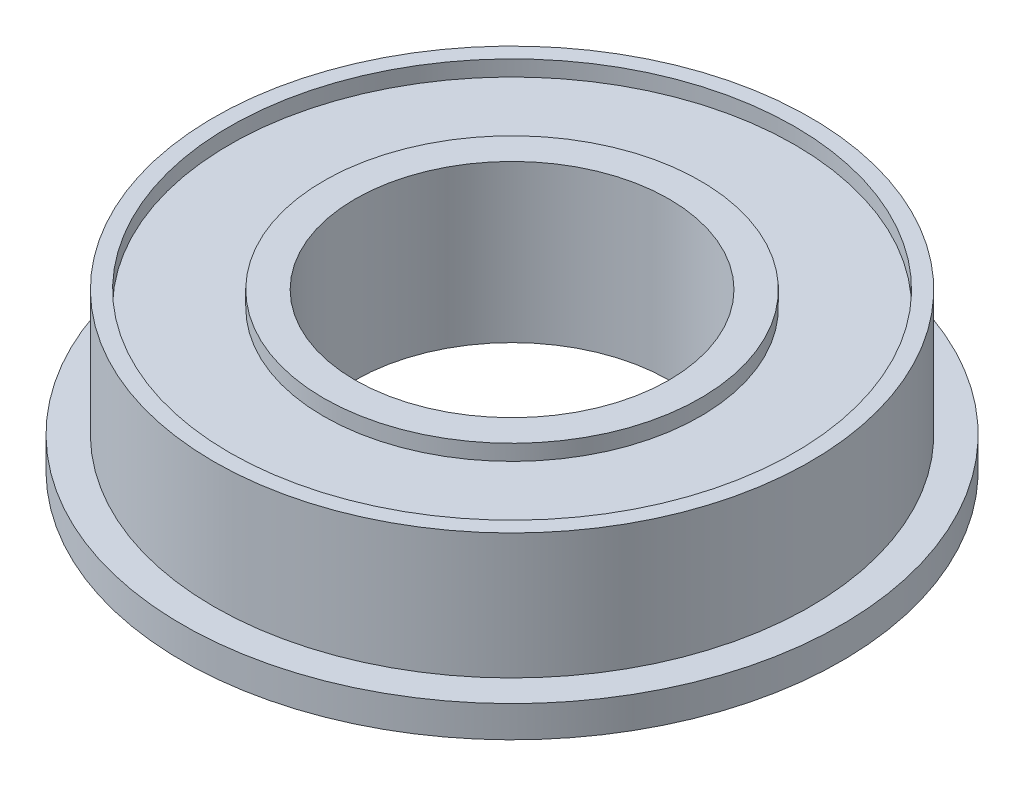
ISO-10303-21;
HEADER;
FILE_DESCRIPTION(('STEP AP214'),'2;1');
FILE_NAME('part.step','',(''),(''),'','','');
FILE_SCHEMA(('AUTOMOTIVE_DESIGN { 1 0 10303 214 1 1 1 1 }'));
ENDSEC;
DATA;
#1=APPLICATION_CONTEXT('core data for automotive mechanical design processes');
#2=APPLICATION_PROTOCOL_DEFINITION('international standard','automotive_design',2000,#1);
#3=PRODUCT_CONTEXT('',#1,'mechanical');
#4=PRODUCT('Part','Part','',(#3));
#5=PRODUCT_RELATED_PRODUCT_CATEGORY('part','',(#4));
#6=PRODUCT_DEFINITION_FORMATION('','',#4);
#7=PRODUCT_DEFINITION_CONTEXT('part definition',#1,'design');
#8=PRODUCT_DEFINITION('design','',#6,#7);
#9=PRODUCT_DEFINITION_SHAPE('','',#8);
#10=(LENGTH_UNIT() NAMED_UNIT(*) SI_UNIT(.MILLI.,.METRE.));
#11=(NAMED_UNIT(*) PLANE_ANGLE_UNIT() SI_UNIT($,.RADIAN.));
#12=(NAMED_UNIT(*) SI_UNIT($,.STERADIAN.) SOLID_ANGLE_UNIT());
#13=UNCERTAINTY_MEASURE_WITH_UNIT(LENGTH_MEASURE(1.E-05),#10,'distance_accuracy_value','');
#14=(GEOMETRIC_REPRESENTATION_CONTEXT(3) GLOBAL_UNCERTAINTY_ASSIGNED_CONTEXT((#13)) GLOBAL_UNIT_ASSIGNED_CONTEXT((#10,
#11,#12)) REPRESENTATION_CONTEXT('',''));
#15=CARTESIAN_POINT('',(0.,0.,0.));
#16=DIRECTION('',(0.,0.,1.));
#17=DIRECTION('',(1.,0.,0.));
#18=AXIS2_PLACEMENT_3D('',#15,#16,#17);
#19=CARTESIAN_POINT('',(0.,-1.,0.));
#20=DIRECTION('',(0.,-1.,0.));
#21=DIRECTION('',(0.,0.,-1.));
#22=AXIS2_PLACEMENT_3D('',#19,#20,#21);
#23=PLANE('',#22);
#24=CARTESIAN_POINT('',(0.,-1.,0.));
#25=DIRECTION('',(0.,-1.,0.));
#26=DIRECTION('',(0.,0.,-1.));
#27=AXIS2_PLACEMENT_3D('',#24,#25,#26);
#28=CIRCLE('',#27,5.);
#29=CARTESIAN_POINT('',(0.,-1.,-5.));
#30=VERTEX_POINT('',#29);
#31=EDGE_CURVE('E60',#30,#30,#28,.F.);
#32=ORIENTED_EDGE('',*,*,#31,.T.);
#33=EDGE_LOOP('',(#32));
#34=FACE_BOUND('',#33,.T.);
#35=CARTESIAN_POINT('',(0.,-1.,0.));
#36=DIRECTION('',(0.,-1.,0.));
#37=DIRECTION('',(0.,0.,-1.));
#38=AXIS2_PLACEMENT_3D('',#35,#36,#37);
#39=CIRCLE('',#38,6.);
#40=CARTESIAN_POINT('',(0.,-1.,-6.));
#41=VERTEX_POINT('',#40);
#42=EDGE_CURVE('E92',#41,#41,#39,.T.);
#43=ORIENTED_EDGE('',*,*,#42,.T.);
#44=EDGE_LOOP('',(#43));
#45=FACE_BOUND('',#44,.T.);
#46=ADVANCED_FACE('F37',(#34,#45),#23,.T.);
#47=CARTESIAN_POINT('',(0.,4.,0.));
#48=DIRECTION('',(0.,1.,0.));
#49=DIRECTION('',(0.,0.,1.));
#50=AXIS2_PLACEMENT_3D('',#47,#48,#49);
#51=PLANE('',#50);
#52=CARTESIAN_POINT('',(0.,4.,0.));
#53=DIRECTION('',(0.,1.,0.));
#54=DIRECTION('',(0.,0.,1.));
#55=AXIS2_PLACEMENT_3D('',#52,#53,#54);
#56=CIRCLE('',#55,5.);
#57=CARTESIAN_POINT('',(0.,4.,5.));
#58=VERTEX_POINT('',#57);
#59=EDGE_CURVE('E56',#58,#58,#56,.T.);
#60=ORIENTED_EDGE('',*,*,#59,.F.);
#61=EDGE_LOOP('',(#60));
#62=FACE_BOUND('',#61,.T.);
#63=CARTESIAN_POINT('',(0.,4.,0.));
#64=DIRECTION('',(0.,1.,0.));
#65=DIRECTION('',(0.,0.,1.));
#66=AXIS2_PLACEMENT_3D('',#63,#64,#65);
#67=CIRCLE('',#66,6.);
#68=CARTESIAN_POINT('',(0.,4.,6.));
#69=VERTEX_POINT('',#68);
#70=EDGE_CURVE('E76',#69,#69,#67,.T.);
#71=ORIENTED_EDGE('',*,*,#70,.T.);
#72=EDGE_LOOP('',(#71));
#73=FACE_BOUND('',#72,.T.);
#74=ADVANCED_FACE('F142',(#62,#73),#51,.T.);
#75=CARTESIAN_POINT('',(0.,4.,0.));
#76=DIRECTION('',(0.,-1.,0.));
#77=DIRECTION('',(0.,0.,-1.));
#78=AXIS2_PLACEMENT_3D('',#75,#76,#77);
#79=CYLINDRICAL_SURFACE('',#78,9.5);
#80=CARTESIAN_POINT('',(0.,4.,0.));
#81=DIRECTION('',(0.,1.,0.));
#82=DIRECTION('',(0.,0.,1.));
#83=AXIS2_PLACEMENT_3D('',#80,#81,#82);
#84=CIRCLE('',#83,9.5);
#85=CARTESIAN_POINT('',(0.,4.,9.5));
#86=VERTEX_POINT('',#85);
#87=EDGE_CURVE('E10',#86,#86,#84,.T.);
#88=ORIENTED_EDGE('',*,*,#87,.F.);
#89=EDGE_LOOP('',(#88));
#90=FACE_BOUND('',#89,.T.);
#91=CARTESIAN_POINT('',(0.,0.,0.));
#92=DIRECTION('',(0.,1.,0.));
#93=DIRECTION('',(0.,0.,1.));
#94=AXIS2_PLACEMENT_3D('',#91,#92,#93);
#95=CIRCLE('',#94,9.5);
#96=CARTESIAN_POINT('',(0.,0.,9.5));
#97=VERTEX_POINT('',#96);
#98=EDGE_CURVE('E41',#97,#97,#95,.T.);
#99=ORIENTED_EDGE('',*,*,#98,.T.);
#100=EDGE_LOOP('',(#99));
#101=FACE_BOUND('',#100,.T.);
#102=ADVANCED_FACE('F39',(#90,#101),#79,.T.);
#103=CARTESIAN_POINT('',(0.,4.,0.));
#104=DIRECTION('',(0.,1.,0.));
#105=DIRECTION('',(0.,0.,1.));
#106=AXIS2_PLACEMENT_3D('',#103,#104,#105);
#107=CIRCLE('',#106,9.);
#108=CARTESIAN_POINT('',(0.,4.,9.));
#109=VERTEX_POINT('',#108);
#110=EDGE_CURVE('E68',#109,#109,#107,.T.);
#111=ORIENTED_EDGE('',*,*,#110,.F.);
#112=EDGE_LOOP('',(#111));
#113=FACE_BOUND('',#112,.T.);
#114=ORIENTED_EDGE('',*,*,#87,.T.);
#115=EDGE_LOOP('',(#114));
#116=FACE_BOUND('',#115,.T.);
#117=ADVANCED_FACE('F126',(#113,#116),#51,.T.);
#118=CARTESIAN_POINT('',(0.,-1.,0.));
#119=DIRECTION('',(0.,1.,0.));
#120=DIRECTION('',(0.,0.,1.));
#121=AXIS2_PLACEMENT_3D('',#118,#119,#120);
#122=CYLINDRICAL_SURFACE('',#121,10.5);
#123=CARTESIAN_POINT('',(0.,-1.,0.));
#124=DIRECTION('',(0.,-1.,0.));
#125=DIRECTION('',(0.,0.,-1.));
#126=AXIS2_PLACEMENT_3D('',#123,#124,#125);
#127=CIRCLE('',#126,10.5);
#128=CARTESIAN_POINT('',(0.,-1.,-10.5));
#129=VERTEX_POINT('',#128);
#130=EDGE_CURVE('E50',#129,#129,#127,.T.);
#131=ORIENTED_EDGE('',*,*,#130,.F.);
#132=EDGE_LOOP('',(#131));
#133=FACE_BOUND('',#132,.T.);
#134=CARTESIAN_POINT('',(0.,0.,0.));
#135=DIRECTION('',(0.,-1.,0.));
#136=DIRECTION('',(0.,0.,-1.));
#137=AXIS2_PLACEMENT_3D('',#134,#135,#136);
#138=CIRCLE('',#137,10.5);
#139=CARTESIAN_POINT('',(0.,0.,-10.5));
#140=VERTEX_POINT('',#139);
#141=EDGE_CURVE('E52',#140,#140,#138,.T.);
#142=ORIENTED_EDGE('',*,*,#141,.T.);
#143=EDGE_LOOP('',(#142));
#144=FACE_BOUND('',#143,.T.);
#145=ADVANCED_FACE('F120',(#133,#144),#122,.T.);
#146=CARTESIAN_POINT('',(0.,-1.,0.));
#147=DIRECTION('',(0.,-1.,0.));
#148=DIRECTION('',(0.,0.,-1.));
#149=AXIS2_PLACEMENT_3D('',#146,#147,#148);
#150=CIRCLE('',#149,9.);
#151=CARTESIAN_POINT('',(0.,-1.,-9.));
#152=VERTEX_POINT('',#151);
#153=EDGE_CURVE('E84',#152,#152,#150,.T.);
#154=ORIENTED_EDGE('',*,*,#153,.F.);
#155=EDGE_LOOP('',(#154));
#156=FACE_BOUND('',#155,.T.);
#157=ORIENTED_EDGE('',*,*,#130,.T.);
#158=EDGE_LOOP('',(#157));
#159=FACE_BOUND('',#158,.T.);
#160=ADVANCED_FACE('F116',(#156,#159),#23,.T.);
#161=CARTESIAN_POINT('',(0.,0.,0.));
#162=DIRECTION('',(0.,-1.,0.));
#163=DIRECTION('',(0.,0.,-1.));
#164=AXIS2_PLACEMENT_3D('',#161,#162,#163);
#165=PLANE('',#164);
#166=ORIENTED_EDGE('',*,*,#98,.F.);
#167=EDGE_LOOP('',(#166));
#168=FACE_BOUND('',#167,.T.);
#169=ORIENTED_EDGE('',*,*,#141,.F.);
#170=EDGE_LOOP('',(#169));
#171=FACE_BOUND('',#170,.T.);
#172=ADVANCED_FACE('F119',(#168,#171),#165,.F.);
#173=CARTESIAN_POINT('',(0.,-1.001,0.));
#174=DIRECTION('',(0.,1.,0.));
#175=DIRECTION('',(0.,0.,1.));
#176=AXIS2_PLACEMENT_3D('',#173,#174,#175);
#177=CYLINDRICAL_SURFACE('',#176,5.);
#178=ORIENTED_EDGE('',*,*,#31,.F.);
#179=EDGE_LOOP('',(#178));
#180=FACE_BOUND('',#179,.T.);
#181=ORIENTED_EDGE('',*,*,#59,.T.);
#182=EDGE_LOOP('',(#181));
#183=FACE_BOUND('',#182,.T.);
#184=ADVANCED_FACE('F131',(#180,#183),#177,.F.);
#185=CARTESIAN_POINT('',(0.,3.5,0.));
#186=DIRECTION('',(0.,1.,0.));
#187=DIRECTION('',(0.,0.,1.));
#188=AXIS2_PLACEMENT_3D('',#185,#186,#187);
#189=CYLINDRICAL_SURFACE('',#188,9.);
#190=CARTESIAN_POINT('',(0.,3.5,0.));
#191=DIRECTION('',(0.,1.,0.));
#192=DIRECTION('',(0.,0.,1.));
#193=AXIS2_PLACEMENT_3D('',#190,#191,#192);
#194=CIRCLE('',#193,9.);
#195=CARTESIAN_POINT('',(0.,3.5,9.));
#196=VERTEX_POINT('',#195);
#197=EDGE_CURVE('E64',#196,#196,#194,.T.);
#198=ORIENTED_EDGE('',*,*,#197,.F.);
#199=EDGE_LOOP('',(#198));
#200=FACE_BOUND('',#199,.T.);
#201=ORIENTED_EDGE('',*,*,#110,.T.);
#202=EDGE_LOOP('',(#201));
#203=FACE_BOUND('',#202,.T.);
#204=ADVANCED_FACE('F137',(#200,#203),#189,.F.);
#205=CARTESIAN_POINT('',(0.,3.5,0.));
#206=DIRECTION('',(0.,1.,0.));
#207=DIRECTION('',(0.,0.,1.));
#208=AXIS2_PLACEMENT_3D('',#205,#206,#207);
#209=PLANE('',#208);
#210=CARTESIAN_POINT('',(0.,3.5,0.));
#211=DIRECTION('',(0.,1.,0.));
#212=DIRECTION('',(0.,0.,1.));
#213=AXIS2_PLACEMENT_3D('',#210,#211,#212);
#214=CIRCLE('',#213,6.);
#215=CARTESIAN_POINT('',(0.,3.5,6.));
#216=VERTEX_POINT('',#215);
#217=EDGE_CURVE('E72',#216,#216,#214,.T.);
#218=ORIENTED_EDGE('',*,*,#217,.F.);
#219=EDGE_LOOP('',(#218));
#220=FACE_BOUND('',#219,.T.);
#221=ORIENTED_EDGE('',*,*,#197,.T.);
#222=EDGE_LOOP('',(#221));
#223=FACE_BOUND('',#222,.T.);
#224=ADVANCED_FACE('F152',(#220,#223),#209,.T.);
#225=CARTESIAN_POINT('',(0.,3.5,0.));
#226=DIRECTION('',(0.,1.,0.));
#227=DIRECTION('',(0.,0.,1.));
#228=AXIS2_PLACEMENT_3D('',#225,#226,#227);
#229=CYLINDRICAL_SURFACE('',#228,6.);
#230=ORIENTED_EDGE('',*,*,#217,.T.);
#231=EDGE_LOOP('',(#230));
#232=FACE_BOUND('',#231,.T.);
#233=ORIENTED_EDGE('',*,*,#70,.F.);
#234=EDGE_LOOP('',(#233));
#235=FACE_BOUND('',#234,.T.);
#236=ADVANCED_FACE('F112',(#232,#235),#229,.T.);
#237=CARTESIAN_POINT('',(0.,-0.5,0.));
#238=DIRECTION('',(0.,-1.,0.));
#239=DIRECTION('',(0.,0.,-1.));
#240=AXIS2_PLACEMENT_3D('',#237,#238,#239);
#241=CYLINDRICAL_SURFACE('',#240,9.);
#242=CARTESIAN_POINT('',(0.,-0.5,0.));
#243=DIRECTION('',(0.,-1.,0.));
#244=DIRECTION('',(0.,0.,-1.));
#245=AXIS2_PLACEMENT_3D('',#242,#243,#244);
#246=CIRCLE('',#245,9.);
#247=CARTESIAN_POINT('',(0.,-0.5,-9.));
#248=VERTEX_POINT('',#247);
#249=EDGE_CURVE('E80',#248,#248,#246,.T.);
#250=ORIENTED_EDGE('',*,*,#249,.F.);
#251=EDGE_LOOP('',(#250));
#252=FACE_BOUND('',#251,.T.);
#253=ORIENTED_EDGE('',*,*,#153,.T.);
#254=EDGE_LOOP('',(#253));
#255=FACE_BOUND('',#254,.T.);
#256=ADVANCED_FACE('F106',(#252,#255),#241,.F.);
#257=CARTESIAN_POINT('',(0.,-0.5,0.));
#258=DIRECTION('',(0.,-1.,0.));
#259=DIRECTION('',(0.,0.,-1.));
#260=AXIS2_PLACEMENT_3D('',#257,#258,#259);
#261=PLANE('',#260);
#262=CARTESIAN_POINT('',(0.,-0.5,0.));
#263=DIRECTION('',(0.,-1.,0.));
#264=DIRECTION('',(0.,0.,-1.));
#265=AXIS2_PLACEMENT_3D('',#262,#263,#264);
#266=CIRCLE('',#265,6.);
#267=CARTESIAN_POINT('',(0.,-0.5,-6.));
#268=VERTEX_POINT('',#267);
#269=EDGE_CURVE('E88',#268,#268,#266,.T.);
#270=ORIENTED_EDGE('',*,*,#269,.F.);
#271=EDGE_LOOP('',(#270));
#272=FACE_BOUND('',#271,.T.);
#273=ORIENTED_EDGE('',*,*,#249,.T.);
#274=EDGE_LOOP('',(#273));
#275=FACE_BOUND('',#274,.T.);
#276=ADVANCED_FACE('F103',(#272,#275),#261,.T.);
#277=CARTESIAN_POINT('',(0.,-0.5,0.));
#278=DIRECTION('',(0.,-1.,0.));
#279=DIRECTION('',(0.,0.,-1.));
#280=AXIS2_PLACEMENT_3D('',#277,#278,#279);
#281=CYLINDRICAL_SURFACE('',#280,6.);
#282=ORIENTED_EDGE('',*,*,#269,.T.);
#283=EDGE_LOOP('',(#282));
#284=FACE_BOUND('',#283,.T.);
#285=ORIENTED_EDGE('',*,*,#42,.F.);
#286=EDGE_LOOP('',(#285));
#287=FACE_BOUND('',#286,.T.);
#288=ADVANCED_FACE('F100',(#284,#287),#281,.T.);
#289=CLOSED_SHELL('',(#46,#74,#102,#117,#145,#160,#172,#184,#204,#224,#236,#256,#276,#288));
#290=MANIFOLD_SOLID_BREP('B2',#289);
#291=ADVANCED_BREP_SHAPE_REPRESENTATION('',(#18,#290),#14);
#292=SHAPE_DEFINITION_REPRESENTATION(#9,#291);
ENDSEC;
END-ISO-10303-21;
